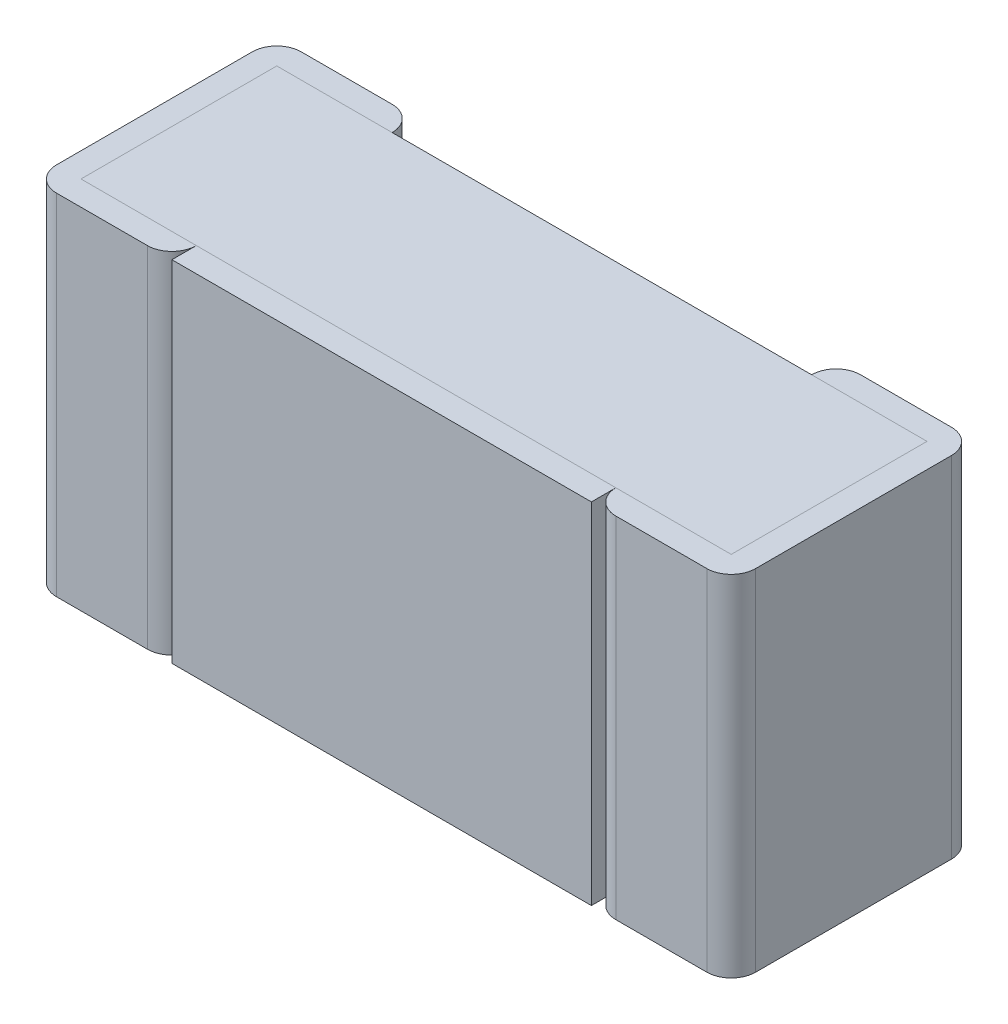
ISO-10303-21;
HEADER;
FILE_DESCRIPTION(('STEP AP214'),'2;1');
FILE_NAME('part.step','',(''),(''),'','','');
FILE_SCHEMA(('AUTOMOTIVE_DESIGN { 1 0 10303 214 1 1 1 1 }'));
ENDSEC;
DATA;
#1=APPLICATION_CONTEXT('core data for automotive mechanical design processes');
#2=APPLICATION_PROTOCOL_DEFINITION('international standard','automotive_design',2000,#1);
#3=PRODUCT_CONTEXT('',#1,'mechanical');
#4=PRODUCT('Part','Part','',(#3));
#5=PRODUCT_RELATED_PRODUCT_CATEGORY('part','',(#4));
#6=PRODUCT_DEFINITION_FORMATION('','',#4);
#7=PRODUCT_DEFINITION_CONTEXT('part definition',#1,'design');
#8=PRODUCT_DEFINITION('design','',#6,#7);
#9=PRODUCT_DEFINITION_SHAPE('','',#8);
#10=(LENGTH_UNIT() NAMED_UNIT(*) SI_UNIT(.MILLI.,.METRE.));
#11=(NAMED_UNIT(*) PLANE_ANGLE_UNIT() SI_UNIT($,.RADIAN.));
#12=(NAMED_UNIT(*) SI_UNIT($,.STERADIAN.) SOLID_ANGLE_UNIT());
#13=UNCERTAINTY_MEASURE_WITH_UNIT(LENGTH_MEASURE(1.E-05),#10,'distance_accuracy_value','');
#14=(GEOMETRIC_REPRESENTATION_CONTEXT(3) GLOBAL_UNCERTAINTY_ASSIGNED_CONTEXT((#13)) GLOBAL_UNIT_ASSIGNED_CONTEXT((#10,
#11,#12)) REPRESENTATION_CONTEXT('',''));
#15=CARTESIAN_POINT('',(0.,0.,0.));
#16=DIRECTION('',(0.,0.,1.));
#17=DIRECTION('',(1.,0.,0.));
#18=AXIS2_PLACEMENT_3D('',#15,#16,#17);
#19=CARTESIAN_POINT('',(-0.3,-0.25,0.35));
#20=DIRECTION('',(0.,0.,1.));
#21=DIRECTION('',(1.,0.,0.));
#22=AXIS2_PLACEMENT_3D('',#19,#20,#21);
#23=PLANE('',#22);
#24=DIRECTION('',(0.,1.,0.));
#25=VECTOR('',#24,1.);
#26=CARTESIAN_POINT('',(-0.3,-0.25,0.35));
#27=LINE('',#26,#25);
#28=CARTESIAN_POINT('',(-0.3,-0.25,0.35));
#29=VERTEX_POINT('',#28);
#30=CARTESIAN_POINT('',(-0.3,0.25,0.35));
#31=VERTEX_POINT('',#30);
#32=EDGE_CURVE('E383',#29,#31,#27,.T.);
#33=ORIENTED_EDGE('',*,*,#32,.F.);
#34=DIRECTION('',(1.,0.,0.));
#35=VECTOR('',#34,1.);
#36=CARTESIAN_POINT('',(-0.3,-0.25,0.35));
#37=LINE('',#36,#35);
#38=CARTESIAN_POINT('',(0.3,-0.25,0.35));
#39=VERTEX_POINT('',#38);
#40=EDGE_CURVE('E384',#29,#39,#37,.T.);
#41=ORIENTED_EDGE('',*,*,#40,.T.);
#42=DIRECTION('',(0.,1.,0.));
#43=VECTOR('',#42,1.);
#44=CARTESIAN_POINT('',(0.3,-0.25,0.35));
#45=LINE('',#44,#43);
#46=CARTESIAN_POINT('',(0.3,0.25,0.35));
#47=VERTEX_POINT('',#46);
#48=EDGE_CURVE('E11',#39,#47,#45,.T.);
#49=ORIENTED_EDGE('',*,*,#48,.T.);
#50=DIRECTION('',(1.,0.,0.));
#51=VECTOR('',#50,1.);
#52=CARTESIAN_POINT('',(-0.3,0.25,0.35));
#53=LINE('',#52,#51);
#54=EDGE_CURVE('E371',#31,#47,#53,.T.);
#55=ORIENTED_EDGE('',*,*,#54,.F.);
#56=EDGE_LOOP('',(#33,#41,#49,#55));
#57=FACE_BOUND('',#56,.T.);
#58=ADVANCED_FACE('F16',(#57),#23,.T.);
#59=CARTESIAN_POINT('',(0.3,-0.25,0.315));
#60=DIRECTION('',(1.,0.,0.));
#61=DIRECTION('',(0.,1.,0.));
#62=AXIS2_PLACEMENT_3D('',#59,#60,#61);
#63=PLANE('',#62);
#64=DIRECTION('',(0.,0.,1.));
#65=VECTOR('',#64,1.);
#66=CARTESIAN_POINT('',(0.3,-0.25,0.315));
#67=LINE('',#66,#65);
#68=CARTESIAN_POINT('',(0.3,-0.25,0.315));
#69=VERTEX_POINT('',#68);
#70=EDGE_CURVE('E472',#69,#39,#67,.T.);
#71=ORIENTED_EDGE('',*,*,#70,.F.);
#72=DIRECTION('',(0.,1.,0.));
#73=VECTOR('',#72,1.);
#74=CARTESIAN_POINT('',(0.3,-0.25,0.315));
#75=LINE('',#74,#73);
#76=CARTESIAN_POINT('',(0.3,0.25,0.315));
#77=VERTEX_POINT('',#76);
#78=EDGE_CURVE('E27',#69,#77,#75,.T.);
#79=ORIENTED_EDGE('',*,*,#78,.T.);
#80=DIRECTION('',(0.,0.,1.));
#81=VECTOR('',#80,1.);
#82=CARTESIAN_POINT('',(0.3,0.25,0.315));
#83=LINE('',#82,#81);
#84=EDGE_CURVE('E367',#77,#47,#83,.T.);
#85=ORIENTED_EDGE('',*,*,#84,.T.);
#86=ORIENTED_EDGE('',*,*,#48,.F.);
#87=EDGE_LOOP('',(#71,#79,#85,#86));
#88=FACE_BOUND('',#87,.T.);
#89=ADVANCED_FACE('F498',(#88),#63,.T.);
#90=CARTESIAN_POINT('',(0.335,-0.25,0.315));
#91=DIRECTION('',(0.,1.,0.));
#92=DIRECTION('',(-1.,0.,0.));
#93=AXIS2_PLACEMENT_3D('',#90,#91,#92);
#94=CYLINDRICAL_SURFACE('',#93,0.035);
#95=CARTESIAN_POINT('',(0.335,-0.25,0.315));
#96=DIRECTION('',(0.,1.,0.));
#97=DIRECTION('',(0.,0.,1.));
#98=AXIS2_PLACEMENT_3D('',#95,#96,#97);
#99=CIRCLE('',#98,0.035);
#100=CARTESIAN_POINT('',(0.335,-0.25,0.35));
#101=VERTEX_POINT('',#100);
#102=EDGE_CURVE('E243',#69,#101,#99,.T.);
#103=ORIENTED_EDGE('',*,*,#102,.T.);
#104=DIRECTION('',(0.,1.,0.));
#105=VECTOR('',#104,1.);
#106=CARTESIAN_POINT('',(0.335,-0.25,0.35));
#107=LINE('',#106,#105);
#108=CARTESIAN_POINT('',(0.335,0.25,0.35));
#109=VERTEX_POINT('',#108);
#110=EDGE_CURVE('E214',#101,#109,#107,.T.);
#111=ORIENTED_EDGE('',*,*,#110,.T.);
#112=CARTESIAN_POINT('',(0.335,0.25,0.315));
#113=DIRECTION('',(0.,1.,0.));
#114=DIRECTION('',(0.,0.,1.));
#115=AXIS2_PLACEMENT_3D('',#112,#113,#114);
#116=CIRCLE('',#115,0.035);
#117=EDGE_CURVE('E230',#77,#109,#116,.T.);
#118=ORIENTED_EDGE('',*,*,#117,.F.);
#119=ORIENTED_EDGE('',*,*,#78,.F.);
#120=EDGE_LOOP('',(#103,#111,#118,#119));
#121=FACE_BOUND('',#120,.T.);
#122=ADVANCED_FACE('F505',(#121),#94,.T.);
#123=CARTESIAN_POINT('',(0.3,-0.25,0.35));
#124=DIRECTION('',(0.,0.,1.));
#125=DIRECTION('',(1.,0.,0.));
#126=AXIS2_PLACEMENT_3D('',#123,#124,#125);
#127=PLANE('',#126);
#128=DIRECTION('',(1.,0.,0.));
#129=VECTOR('',#128,1.);
#130=CARTESIAN_POINT('',(0.3,0.25,0.35));
#131=LINE('',#130,#129);
#132=CARTESIAN_POINT('',(0.465,0.25,0.35));
#133=VERTEX_POINT('',#132);
#134=EDGE_CURVE('E206',#109,#133,#131,.T.);
#135=ORIENTED_EDGE('',*,*,#134,.F.);
#136=ORIENTED_EDGE('',*,*,#110,.F.);
#137=DIRECTION('',(1.,0.,0.));
#138=VECTOR('',#137,1.);
#139=CARTESIAN_POINT('',(0.3,-0.25,0.35));
#140=LINE('',#139,#138);
#141=CARTESIAN_POINT('',(0.465,-0.25,0.35));
#142=VERTEX_POINT('',#141);
#143=EDGE_CURVE('E209',#101,#142,#140,.T.);
#144=ORIENTED_EDGE('',*,*,#143,.T.);
#145=DIRECTION('',(0.,1.,0.));
#146=VECTOR('',#145,1.);
#147=CARTESIAN_POINT('',(0.465,-0.25,0.35));
#148=LINE('',#147,#146);
#149=EDGE_CURVE('E202',#142,#133,#148,.T.);
#150=ORIENTED_EDGE('',*,*,#149,.T.);
#151=EDGE_LOOP('',(#135,#136,#144,#150));
#152=FACE_BOUND('',#151,.T.);
#153=ADVANCED_FACE('F204',(#152),#127,.T.);
#154=CARTESIAN_POINT('',(0.465,-0.25,0.315));
#155=DIRECTION('',(0.,1.,0.));
#156=DIRECTION('',(1.,0.,0.));
#157=AXIS2_PLACEMENT_3D('',#154,#155,#156);
#158=CYLINDRICAL_SURFACE('',#157,0.035);
#159=DIRECTION('',(0.,1.,0.));
#160=VECTOR('',#159,1.);
#161=CARTESIAN_POINT('',(0.5,-0.25,0.315));
#162=LINE('',#161,#160);
#163=CARTESIAN_POINT('',(0.5,-0.25,0.315));
#164=VERTEX_POINT('',#163);
#165=CARTESIAN_POINT('',(0.5,0.25,0.315));
#166=VERTEX_POINT('',#165);
#167=EDGE_CURVE('E215',#164,#166,#162,.T.);
#168=ORIENTED_EDGE('',*,*,#167,.T.);
#169=CARTESIAN_POINT('',(0.465,0.25,0.315));
#170=DIRECTION('',(0.,-1.,0.));
#171=DIRECTION('',(0.,0.,1.));
#172=AXIS2_PLACEMENT_3D('',#169,#170,#171);
#173=CIRCLE('',#172,0.035);
#174=EDGE_CURVE('E218',#166,#133,#173,.T.);
#175=ORIENTED_EDGE('',*,*,#174,.T.);
#176=ORIENTED_EDGE('',*,*,#149,.F.);
#177=CARTESIAN_POINT('',(0.465,-0.25,0.315));
#178=DIRECTION('',(0.,-1.,0.));
#179=DIRECTION('',(0.,0.,1.));
#180=AXIS2_PLACEMENT_3D('',#177,#178,#179);
#181=CIRCLE('',#180,0.035);
#182=EDGE_CURVE('E287',#164,#142,#181,.T.);
#183=ORIENTED_EDGE('',*,*,#182,.F.);
#184=EDGE_LOOP('',(#168,#175,#176,#183));
#185=FACE_BOUND('',#184,.T.);
#186=ADVANCED_FACE('F219',(#185),#158,.T.);
#187=CARTESIAN_POINT('',(0.5,-0.25,0.));
#188=DIRECTION('',(1.,0.,0.));
#189=DIRECTION('',(0.,1.,0.));
#190=AXIS2_PLACEMENT_3D('',#187,#188,#189);
#191=PLANE('',#190);
#192=DIRECTION('',(0.,0.,1.));
#193=VECTOR('',#192,1.);
#194=CARTESIAN_POINT('',(0.5,-0.25,0.));
#195=LINE('',#194,#193);
#196=CARTESIAN_POINT('',(0.5,-0.25,0.035));
#197=VERTEX_POINT('',#196);
#198=EDGE_CURVE('E283',#197,#164,#195,.T.);
#199=ORIENTED_EDGE('',*,*,#198,.F.);
#200=DIRECTION('',(0.,1.,0.));
#201=VECTOR('',#200,1.);
#202=CARTESIAN_POINT('',(0.5,-0.25,0.035));
#203=LINE('',#202,#201);
#204=CARTESIAN_POINT('',(0.5,0.25,0.035));
#205=VERTEX_POINT('',#204);
#206=EDGE_CURVE('E330',#197,#205,#203,.T.);
#207=ORIENTED_EDGE('',*,*,#206,.T.);
#208=DIRECTION('',(0.,0.,1.));
#209=VECTOR('',#208,1.);
#210=CARTESIAN_POINT('',(0.5,0.25,0.));
#211=LINE('',#210,#209);
#212=EDGE_CURVE('E224',#205,#166,#211,.T.);
#213=ORIENTED_EDGE('',*,*,#212,.T.);
#214=ORIENTED_EDGE('',*,*,#167,.F.);
#215=EDGE_LOOP('',(#199,#207,#213,#214));
#216=FACE_BOUND('',#215,.T.);
#217=ADVANCED_FACE('F551',(#216),#191,.T.);
#218=CARTESIAN_POINT('',(0.465,-0.25,0.035));
#219=DIRECTION('',(0.,1.,0.));
#220=DIRECTION('',(1.,0.,0.));
#221=AXIS2_PLACEMENT_3D('',#218,#219,#220);
#222=CYLINDRICAL_SURFACE('',#221,0.035);
#223=CARTESIAN_POINT('',(0.465,-0.25,0.035));
#224=DIRECTION('',(0.,1.,0.));
#225=DIRECTION('',(0.,0.,1.));
#226=AXIS2_PLACEMENT_3D('',#223,#224,#225);
#227=CIRCLE('',#226,0.035);
#228=CARTESIAN_POINT('',(0.465,-0.25,0.));
#229=VERTEX_POINT('',#228);
#230=EDGE_CURVE('E288',#197,#229,#227,.T.);
#231=ORIENTED_EDGE('',*,*,#230,.T.);
#232=DIRECTION('',(0.,1.,0.));
#233=VECTOR('',#232,1.);
#234=CARTESIAN_POINT('',(0.465,-0.25,0.));
#235=LINE('',#234,#233);
#236=CARTESIAN_POINT('',(0.465,0.25,0.));
#237=VERTEX_POINT('',#236);
#238=EDGE_CURVE('E385',#229,#237,#235,.T.);
#239=ORIENTED_EDGE('',*,*,#238,.T.);
#240=CARTESIAN_POINT('',(0.465,0.25,0.035));
#241=DIRECTION('',(0.,1.,0.));
#242=DIRECTION('',(0.,0.,1.));
#243=AXIS2_PLACEMENT_3D('',#240,#241,#242);
#244=CIRCLE('',#243,0.035);
#245=EDGE_CURVE('E266',#205,#237,#244,.T.);
#246=ORIENTED_EDGE('',*,*,#245,.F.);
#247=ORIENTED_EDGE('',*,*,#206,.F.);
#248=EDGE_LOOP('',(#231,#239,#246,#247));
#249=FACE_BOUND('',#248,.T.);
#250=ADVANCED_FACE('F548',(#249),#222,.T.);
#251=CARTESIAN_POINT('',(0.3,-0.25,0.));
#252=DIRECTION('',(0.,0.,1.));
#253=DIRECTION('',(1.,0.,0.));
#254=AXIS2_PLACEMENT_3D('',#251,#252,#253);
#255=PLANE('',#254);
#256=ORIENTED_EDGE('',*,*,#238,.F.);
#257=DIRECTION('',(1.,0.,0.));
#258=VECTOR('',#257,1.);
#259=CARTESIAN_POINT('',(0.3,-0.25,0.));
#260=LINE('',#259,#258);
#261=CARTESIAN_POINT('',(0.335,-0.25,0.));
#262=VERTEX_POINT('',#261);
#263=EDGE_CURVE('E476',#262,#229,#260,.T.);
#264=ORIENTED_EDGE('',*,*,#263,.F.);
#265=DIRECTION('',(0.,1.,0.));
#266=VECTOR('',#265,1.);
#267=CARTESIAN_POINT('',(0.335,-0.25,0.));
#268=LINE('',#267,#266);
#269=CARTESIAN_POINT('',(0.335,0.25,0.));
#270=VERTEX_POINT('',#269);
#271=EDGE_CURVE('E370',#262,#270,#268,.T.);
#272=ORIENTED_EDGE('',*,*,#271,.T.);
#273=DIRECTION('',(1.,0.,0.));
#274=VECTOR('',#273,1.);
#275=CARTESIAN_POINT('',(0.3,0.25,0.));
#276=LINE('',#275,#274);
#277=EDGE_CURVE('E450',#270,#237,#276,.T.);
#278=ORIENTED_EDGE('',*,*,#277,.T.);
#279=EDGE_LOOP('',(#256,#264,#272,#278));
#280=FACE_BOUND('',#279,.T.);
#281=ADVANCED_FACE('F538',(#280),#255,.F.);
#282=CARTESIAN_POINT('',(0.335,-0.25,0.035));
#283=DIRECTION('',(0.,1.,0.));
#284=DIRECTION('',(-1.,0.,0.));
#285=AXIS2_PLACEMENT_3D('',#282,#283,#284);
#286=CYLINDRICAL_SURFACE('',#285,0.035);
#287=DIRECTION('',(0.,1.,0.));
#288=VECTOR('',#287,1.);
#289=CARTESIAN_POINT('',(0.3,-0.25,0.035));
#290=LINE('',#289,#288);
#291=CARTESIAN_POINT('',(0.3,-0.25,0.035));
#292=VERTEX_POINT('',#291);
#293=CARTESIAN_POINT('',(0.3,0.25,0.035));
#294=VERTEX_POINT('',#293);
#295=EDGE_CURVE('E319',#292,#294,#290,.T.);
#296=ORIENTED_EDGE('',*,*,#295,.T.);
#297=CARTESIAN_POINT('',(0.335,0.25,0.035));
#298=DIRECTION('',(0.,-1.,0.));
#299=DIRECTION('',(0.,0.,1.));
#300=AXIS2_PLACEMENT_3D('',#297,#298,#299);
#301=CIRCLE('',#300,0.035);
#302=EDGE_CURVE('E237',#294,#270,#301,.T.);
#303=ORIENTED_EDGE('',*,*,#302,.T.);
#304=ORIENTED_EDGE('',*,*,#271,.F.);
#305=CARTESIAN_POINT('',(0.335,-0.25,0.035));
#306=DIRECTION('',(0.,-1.,0.));
#307=DIRECTION('',(0.,0.,1.));
#308=AXIS2_PLACEMENT_3D('',#305,#306,#307);
#309=CIRCLE('',#308,0.035);
#310=EDGE_CURVE('E246',#292,#262,#309,.T.);
#311=ORIENTED_EDGE('',*,*,#310,.F.);
#312=EDGE_LOOP('',(#296,#303,#304,#311));
#313=FACE_BOUND('',#312,.T.);
#314=ADVANCED_FACE('F533',(#313),#286,.T.);
#315=CARTESIAN_POINT('',(-0.3,0.25,0.315));
#316=DIRECTION('',(0.,1.,0.));
#317=DIRECTION('',(1.,0.,0.));
#318=AXIS2_PLACEMENT_3D('',#315,#316,#317);
#319=PLANE('',#318);
#320=DIRECTION('',(1.,0.,0.));
#321=VECTOR('',#320,1.);
#322=CARTESIAN_POINT('',(-0.3,0.25,0.315));
#323=LINE('',#322,#321);
#324=CARTESIAN_POINT('',(-0.3,0.25,0.315));
#325=VERTEX_POINT('',#324);
#326=EDGE_CURVE('E258',#325,#77,#323,.T.);
#327=ORIENTED_EDGE('',*,*,#326,.F.);
#328=DIRECTION('',(0.,0.,1.));
#329=VECTOR('',#328,1.);
#330=CARTESIAN_POINT('',(-0.3,0.25,0.315));
#331=LINE('',#330,#329);
#332=EDGE_CURVE('E408',#325,#31,#331,.T.);
#333=ORIENTED_EDGE('',*,*,#332,.T.);
#334=ORIENTED_EDGE('',*,*,#54,.T.);
#335=ORIENTED_EDGE('',*,*,#84,.F.);
#336=EDGE_LOOP('',(#327,#333,#334,#335));
#337=FACE_BOUND('',#336,.T.);
#338=ADVANCED_FACE('F513',(#337),#319,.T.);
#339=CARTESIAN_POINT('',(0.3,0.25,0.));
#340=DIRECTION('',(0.,1.,0.));
#341=DIRECTION('',(1.,0.,0.));
#342=AXIS2_PLACEMENT_3D('',#339,#340,#341);
#343=PLANE('',#342);
#344=ORIENTED_EDGE('',*,*,#277,.F.);
#345=ORIENTED_EDGE('',*,*,#302,.F.);
#346=DIRECTION('',(1.,0.,0.));
#347=VECTOR('',#346,1.);
#348=CARTESIAN_POINT('',(-0.465,0.25,0.035));
#349=LINE('',#348,#347);
#350=CARTESIAN_POINT('',(0.465,0.25,0.035));
#351=VERTEX_POINT('',#350);
#352=EDGE_CURVE('E402',#294,#351,#349,.T.);
#353=ORIENTED_EDGE('',*,*,#352,.T.);
#354=DIRECTION('',(0.,0.,1.));
#355=VECTOR('',#354,1.);
#356=CARTESIAN_POINT('',(0.465,0.25,0.035));
#357=LINE('',#356,#355);
#358=CARTESIAN_POINT('',(0.465,0.25,0.315));
#359=VERTEX_POINT('',#358);
#360=EDGE_CURVE('E257',#351,#359,#357,.T.);
#361=ORIENTED_EDGE('',*,*,#360,.T.);
#362=DIRECTION('',(1.,0.,0.));
#363=VECTOR('',#362,1.);
#364=CARTESIAN_POINT('',(-0.465,0.25,0.315));
#365=LINE('',#364,#363);
#366=EDGE_CURVE('E253',#77,#359,#365,.T.);
#367=ORIENTED_EDGE('',*,*,#366,.F.);
#368=ORIENTED_EDGE('',*,*,#117,.T.);
#369=ORIENTED_EDGE('',*,*,#134,.T.);
#370=ORIENTED_EDGE('',*,*,#174,.F.);
#371=ORIENTED_EDGE('',*,*,#212,.F.);
#372=ORIENTED_EDGE('',*,*,#245,.T.);
#373=EDGE_LOOP('',(#344,#345,#353,#361,#367,#368,#369,#370,#371,#372));
#374=FACE_BOUND('',#373,.T.);
#375=ADVANCED_FACE('F227',(#374),#343,.T.);
#376=CARTESIAN_POINT('',(-0.3,-0.25,0.315));
#377=DIRECTION('',(1.,0.,0.));
#378=DIRECTION('',(0.,1.,0.));
#379=AXIS2_PLACEMENT_3D('',#376,#377,#378);
#380=PLANE('',#379);
#381=ORIENTED_EDGE('',*,*,#32,.T.);
#382=ORIENTED_EDGE('',*,*,#332,.F.);
#383=DIRECTION('',(0.,1.,0.));
#384=VECTOR('',#383,1.);
#385=CARTESIAN_POINT('',(-0.3,-0.25,0.315));
#386=LINE('',#385,#384);
#387=CARTESIAN_POINT('',(-0.3,-0.25,0.315));
#388=VERTEX_POINT('',#387);
#389=EDGE_CURVE('E324',#388,#325,#386,.T.);
#390=ORIENTED_EDGE('',*,*,#389,.F.);
#391=DIRECTION('',(0.,0.,1.));
#392=VECTOR('',#391,1.);
#393=CARTESIAN_POINT('',(-0.3,-0.25,0.315));
#394=LINE('',#393,#392);
#395=EDGE_CURVE('E379',#388,#29,#394,.T.);
#396=ORIENTED_EDGE('',*,*,#395,.T.);
#397=EDGE_LOOP('',(#381,#382,#390,#396));
#398=FACE_BOUND('',#397,.T.);
#399=ADVANCED_FACE('F518',(#398),#380,.F.);
#400=CARTESIAN_POINT('',(-0.3,-0.25,0.315));
#401=DIRECTION('',(0.,1.,0.));
#402=DIRECTION('',(1.,0.,0.));
#403=AXIS2_PLACEMENT_3D('',#400,#401,#402);
#404=PLANE('',#403);
#405=ORIENTED_EDGE('',*,*,#70,.T.);
#406=ORIENTED_EDGE('',*,*,#40,.F.);
#407=ORIENTED_EDGE('',*,*,#395,.F.);
#408=DIRECTION('',(1.,0.,0.));
#409=VECTOR('',#408,1.);
#410=CARTESIAN_POINT('',(-0.3,-0.25,0.315));
#411=LINE('',#410,#409);
#412=EDGE_CURVE('E303',#388,#69,#411,.T.);
#413=ORIENTED_EDGE('',*,*,#412,.T.);
#414=EDGE_LOOP('',(#405,#406,#407,#413));
#415=FACE_BOUND('',#414,.T.);
#416=ADVANCED_FACE('F493',(#415),#404,.F.);
#417=CARTESIAN_POINT('',(0.3,-0.25,0.));
#418=DIRECTION('',(0.,1.,0.));
#419=DIRECTION('',(1.,0.,0.));
#420=AXIS2_PLACEMENT_3D('',#417,#418,#419);
#421=PLANE('',#420);
#422=ORIENTED_EDGE('',*,*,#230,.F.);
#423=ORIENTED_EDGE('',*,*,#198,.T.);
#424=ORIENTED_EDGE('',*,*,#182,.T.);
#425=ORIENTED_EDGE('',*,*,#143,.F.);
#426=ORIENTED_EDGE('',*,*,#102,.F.);
#427=DIRECTION('',(1.,0.,0.));
#428=VECTOR('',#427,1.);
#429=CARTESIAN_POINT('',(-0.465,-0.25,0.315));
#430=LINE('',#429,#428);
#431=CARTESIAN_POINT('',(0.465,-0.25,0.315));
#432=VERTEX_POINT('',#431);
#433=EDGE_CURVE('E308',#69,#432,#430,.T.);
#434=ORIENTED_EDGE('',*,*,#433,.T.);
#435=DIRECTION('',(0.,0.,1.));
#436=VECTOR('',#435,1.);
#437=CARTESIAN_POINT('',(0.465,-0.25,0.035));
#438=LINE('',#437,#436);
#439=CARTESIAN_POINT('',(0.465,-0.25,0.035));
#440=VERTEX_POINT('',#439);
#441=EDGE_CURVE('E343',#440,#432,#438,.T.);
#442=ORIENTED_EDGE('',*,*,#441,.F.);
#443=DIRECTION('',(1.,0.,0.));
#444=VECTOR('',#443,1.);
#445=CARTESIAN_POINT('',(-0.465,-0.25,0.035));
#446=LINE('',#445,#444);
#447=EDGE_CURVE('E339',#292,#440,#446,.T.);
#448=ORIENTED_EDGE('',*,*,#447,.F.);
#449=ORIENTED_EDGE('',*,*,#310,.T.);
#450=ORIENTED_EDGE('',*,*,#263,.T.);
#451=EDGE_LOOP('',(#422,#423,#424,#425,#426,#434,#442,#448,#449,#450));
#452=FACE_BOUND('',#451,.T.);
#453=ADVANCED_FACE('F502',(#452),#421,.F.);
#454=CARTESIAN_POINT('',(-0.465,-0.25,0.035));
#455=DIRECTION('',(0.,0.,1.));
#456=DIRECTION('',(1.,0.,0.));
#457=AXIS2_PLACEMENT_3D('',#454,#455,#456);
#458=PLANE('',#457);
#459=DIRECTION('',(1.,0.,0.));
#460=VECTOR('',#459,1.);
#461=CARTESIAN_POINT('',(-0.465,0.25,0.035));
#462=LINE('',#461,#460);
#463=CARTESIAN_POINT('',(-0.3,0.25,0.035));
#464=VERTEX_POINT('',#463);
#465=EDGE_CURVE('E323',#464,#294,#462,.T.);
#466=ORIENTED_EDGE('',*,*,#465,.T.);
#467=ORIENTED_EDGE('',*,*,#295,.F.);
#468=DIRECTION('',(1.,0.,0.));
#469=VECTOR('',#468,1.);
#470=CARTESIAN_POINT('',(-0.465,-0.25,0.035));
#471=LINE('',#470,#469);
#472=CARTESIAN_POINT('',(-0.3,-0.25,0.035));
#473=VERTEX_POINT('',#472);
#474=EDGE_CURVE('E344',#473,#292,#471,.T.);
#475=ORIENTED_EDGE('',*,*,#474,.F.);
#476=DIRECTION('',(0.,1.,0.));
#477=VECTOR('',#476,1.);
#478=CARTESIAN_POINT('',(-0.3,-0.25,0.035));
#479=LINE('',#478,#477);
#480=EDGE_CURVE('E334',#473,#464,#479,.T.);
#481=ORIENTED_EDGE('',*,*,#480,.T.);
#482=EDGE_LOOP('',(#466,#467,#475,#481));
#483=FACE_BOUND('',#482,.T.);
#484=ADVANCED_FACE('F602',(#483),#458,.F.);
#485=CARTESIAN_POINT('',(-0.465,0.25,0.035));
#486=DIRECTION('',(0.,1.,0.));
#487=DIRECTION('',(1.,0.,0.));
#488=AXIS2_PLACEMENT_3D('',#485,#486,#487);
#489=PLANE('',#488);
#490=DIRECTION('',(1.,0.,0.));
#491=VECTOR('',#490,1.);
#492=CARTESIAN_POINT('',(-0.465,0.25,0.035));
#493=LINE('',#492,#491);
#494=CARTESIAN_POINT('',(-0.465,0.25,0.035));
#495=VERTEX_POINT('',#494);
#496=EDGE_CURVE('E309',#495,#464,#493,.T.);
#497=ORIENTED_EDGE('',*,*,#496,.F.);
#498=DIRECTION('',(0.,0.,1.));
#499=VECTOR('',#498,1.);
#500=CARTESIAN_POINT('',(-0.465,0.25,0.035));
#501=LINE('',#500,#499);
#502=CARTESIAN_POINT('',(-0.465,0.25,0.315));
#503=VERTEX_POINT('',#502);
#504=EDGE_CURVE('E281',#495,#503,#501,.T.);
#505=ORIENTED_EDGE('',*,*,#504,.T.);
#506=DIRECTION('',(1.,0.,0.));
#507=VECTOR('',#506,1.);
#508=CARTESIAN_POINT('',(-0.465,0.25,0.315));
#509=LINE('',#508,#507);
#510=EDGE_CURVE('E277',#503,#325,#509,.T.);
#511=ORIENTED_EDGE('',*,*,#510,.T.);
#512=ORIENTED_EDGE('',*,*,#326,.T.);
#513=ORIENTED_EDGE('',*,*,#366,.T.);
#514=ORIENTED_EDGE('',*,*,#360,.F.);
#515=ORIENTED_EDGE('',*,*,#352,.F.);
#516=ORIENTED_EDGE('',*,*,#465,.F.);
#517=EDGE_LOOP('',(#497,#505,#511,#512,#513,#514,#515,#516));
#518=FACE_BOUND('',#517,.T.);
#519=ADVANCED_FACE('F510',(#518),#489,.T.);
#520=CARTESIAN_POINT('',(-0.335,-0.25,0.315));
#521=DIRECTION('',(0.,1.,0.));
#522=DIRECTION('',(1.,0.,0.));
#523=AXIS2_PLACEMENT_3D('',#520,#521,#522);
#524=CYLINDRICAL_SURFACE('',#523,0.035);
#525=ORIENTED_EDGE('',*,*,#389,.T.);
#526=CARTESIAN_POINT('',(-0.335,0.25,0.315));
#527=DIRECTION('',(0.,-1.,0.));
#528=DIRECTION('',(0.,0.,1.));
#529=AXIS2_PLACEMENT_3D('',#526,#527,#528);
#530=CIRCLE('',#529,0.035);
#531=CARTESIAN_POINT('',(-0.335,0.25,0.35));
#532=VERTEX_POINT('',#531);
#533=EDGE_CURVE('E282',#325,#532,#530,.T.);
#534=ORIENTED_EDGE('',*,*,#533,.T.);
#535=DIRECTION('',(0.,1.,0.));
#536=VECTOR('',#535,1.);
#537=CARTESIAN_POINT('',(-0.335,-0.25,0.35));
#538=LINE('',#537,#536);
#539=CARTESIAN_POINT('',(-0.335,-0.25,0.35));
#540=VERTEX_POINT('',#539);
#541=EDGE_CURVE('E307',#540,#532,#538,.T.);
#542=ORIENTED_EDGE('',*,*,#541,.F.);
#543=CARTESIAN_POINT('',(-0.335,-0.25,0.315));
#544=DIRECTION('',(0.,-1.,0.));
#545=DIRECTION('',(0.,0.,1.));
#546=AXIS2_PLACEMENT_3D('',#543,#544,#545);
#547=CIRCLE('',#546,0.035);
#548=EDGE_CURVE('E20',#388,#540,#547,.T.);
#549=ORIENTED_EDGE('',*,*,#548,.F.);
#550=EDGE_LOOP('',(#525,#534,#542,#549));
#551=FACE_BOUND('',#550,.T.);
#552=ADVANCED_FACE('F516',(#551),#524,.T.);
#553=CARTESIAN_POINT('',(-0.5,-0.25,0.35));
#554=DIRECTION('',(0.,0.,1.));
#555=DIRECTION('',(1.,0.,0.));
#556=AXIS2_PLACEMENT_3D('',#553,#554,#555);
#557=PLANE('',#556);
#558=DIRECTION('',(1.,0.,0.));
#559=VECTOR('',#558,1.);
#560=CARTESIAN_POINT('',(-0.5,0.25,0.35));
#561=LINE('',#560,#559);
#562=CARTESIAN_POINT('',(-0.465,0.25,0.35));
#563=VERTEX_POINT('',#562);
#564=EDGE_CURVE('E270',#563,#532,#561,.T.);
#565=ORIENTED_EDGE('',*,*,#564,.F.);
#566=DIRECTION('',(0.,1.,0.));
#567=VECTOR('',#566,1.);
#568=CARTESIAN_POINT('',(-0.465,-0.25,0.35));
#569=LINE('',#568,#567);
#570=CARTESIAN_POINT('',(-0.465,-0.25,0.35));
#571=VERTEX_POINT('',#570);
#572=EDGE_CURVE('E276',#571,#563,#569,.T.);
#573=ORIENTED_EDGE('',*,*,#572,.F.);
#574=DIRECTION('',(1.,0.,0.));
#575=VECTOR('',#574,1.);
#576=CARTESIAN_POINT('',(-0.5,-0.25,0.35));
#577=LINE('',#576,#575);
#578=EDGE_CURVE('E396',#571,#540,#577,.T.);
#579=ORIENTED_EDGE('',*,*,#578,.T.);
#580=ORIENTED_EDGE('',*,*,#541,.T.);
#581=EDGE_LOOP('',(#565,#573,#579,#580));
#582=FACE_BOUND('',#581,.T.);
#583=ADVANCED_FACE('F429',(#582),#557,.T.);
#584=CARTESIAN_POINT('',(-0.465,-0.25,0.035));
#585=DIRECTION('',(0.,1.,0.));
#586=DIRECTION('',(1.,0.,0.));
#587=AXIS2_PLACEMENT_3D('',#584,#585,#586);
#588=PLANE('',#587);
#589=ORIENTED_EDGE('',*,*,#474,.T.);
#590=ORIENTED_EDGE('',*,*,#447,.T.);
#591=ORIENTED_EDGE('',*,*,#441,.T.);
#592=ORIENTED_EDGE('',*,*,#433,.F.);
#593=ORIENTED_EDGE('',*,*,#412,.F.);
#594=DIRECTION('',(1.,0.,0.));
#595=VECTOR('',#594,1.);
#596=CARTESIAN_POINT('',(-0.465,-0.25,0.315));
#597=LINE('',#596,#595);
#598=CARTESIAN_POINT('',(-0.465,-0.25,0.315));
#599=VERTEX_POINT('',#598);
#600=EDGE_CURVE('E298',#599,#388,#597,.T.);
#601=ORIENTED_EDGE('',*,*,#600,.F.);
#602=DIRECTION('',(0.,0.,1.));
#603=VECTOR('',#602,1.);
#604=CARTESIAN_POINT('',(-0.465,-0.25,0.035));
#605=LINE('',#604,#603);
#606=CARTESIAN_POINT('',(-0.465,-0.25,0.035));
#607=VERTEX_POINT('',#606);
#608=EDGE_CURVE('E302',#607,#599,#605,.T.);
#609=ORIENTED_EDGE('',*,*,#608,.F.);
#610=DIRECTION('',(1.,0.,0.));
#611=VECTOR('',#610,1.);
#612=CARTESIAN_POINT('',(-0.465,-0.25,0.035));
#613=LINE('',#612,#611);
#614=EDGE_CURVE('E241',#607,#473,#613,.T.);
#615=ORIENTED_EDGE('',*,*,#614,.T.);
#616=EDGE_LOOP('',(#589,#590,#591,#592,#593,#601,#609,#615));
#617=FACE_BOUND('',#616,.T.);
#618=ADVANCED_FACE('F520',(#617),#588,.F.);
#619=CARTESIAN_POINT('',(-0.335,-0.25,0.035));
#620=DIRECTION('',(0.,1.,0.));
#621=DIRECTION('',(1.,0.,0.));
#622=AXIS2_PLACEMENT_3D('',#619,#620,#621);
#623=CYLINDRICAL_SURFACE('',#622,0.035);
#624=CARTESIAN_POINT('',(-0.335,-0.25,0.035));
#625=DIRECTION('',(0.,1.,0.));
#626=DIRECTION('',(0.,0.,1.));
#627=AXIS2_PLACEMENT_3D('',#624,#625,#626);
#628=CIRCLE('',#627,0.035);
#629=CARTESIAN_POINT('',(-0.335,-0.25,0.));
#630=VERTEX_POINT('',#629);
#631=EDGE_CURVE('E357',#473,#630,#628,.T.);
#632=ORIENTED_EDGE('',*,*,#631,.T.);
#633=DIRECTION('',(0.,1.,0.));
#634=VECTOR('',#633,1.);
#635=CARTESIAN_POINT('',(-0.335,-0.25,0.));
#636=LINE('',#635,#634);
#637=CARTESIAN_POINT('',(-0.335,0.25,0.));
#638=VERTEX_POINT('',#637);
#639=EDGE_CURVE('E331',#630,#638,#636,.T.);
#640=ORIENTED_EDGE('',*,*,#639,.T.);
#641=CARTESIAN_POINT('',(-0.335,0.25,0.035));
#642=DIRECTION('',(0.,1.,0.));
#643=DIRECTION('',(0.,0.,1.));
#644=AXIS2_PLACEMENT_3D('',#641,#642,#643);
#645=CIRCLE('',#644,0.035);
#646=EDGE_CURVE('E313',#464,#638,#645,.T.);
#647=ORIENTED_EDGE('',*,*,#646,.F.);
#648=ORIENTED_EDGE('',*,*,#480,.F.);
#649=EDGE_LOOP('',(#632,#640,#647,#648));
#650=FACE_BOUND('',#649,.T.);
#651=ADVANCED_FACE('F574',(#650),#623,.T.);
#652=CARTESIAN_POINT('',(-0.5,-0.25,0.));
#653=DIRECTION('',(0.,0.,1.));
#654=DIRECTION('',(1.,0.,0.));
#655=AXIS2_PLACEMENT_3D('',#652,#653,#654);
#656=PLANE('',#655);
#657=ORIENTED_EDGE('',*,*,#639,.F.);
#658=DIRECTION('',(1.,0.,0.));
#659=VECTOR('',#658,1.);
#660=CARTESIAN_POINT('',(-0.5,-0.25,0.));
#661=LINE('',#660,#659);
#662=CARTESIAN_POINT('',(-0.465,-0.25,0.));
#663=VERTEX_POINT('',#662);
#664=EDGE_CURVE('E252',#663,#630,#661,.T.);
#665=ORIENTED_EDGE('',*,*,#664,.F.);
#666=DIRECTION('',(0.,1.,0.));
#667=VECTOR('',#666,1.);
#668=CARTESIAN_POINT('',(-0.465,-0.25,0.));
#669=LINE('',#668,#667);
#670=CARTESIAN_POINT('',(-0.465,0.25,0.));
#671=VERTEX_POINT('',#670);
#672=EDGE_CURVE('E251',#663,#671,#669,.T.);
#673=ORIENTED_EDGE('',*,*,#672,.T.);
#674=DIRECTION('',(1.,0.,0.));
#675=VECTOR('',#674,1.);
#676=CARTESIAN_POINT('',(-0.5,0.25,0.));
#677=LINE('',#676,#675);
#678=EDGE_CURVE('E267',#671,#638,#677,.T.);
#679=ORIENTED_EDGE('',*,*,#678,.T.);
#680=EDGE_LOOP('',(#657,#665,#673,#679));
#681=FACE_BOUND('',#680,.T.);
#682=ADVANCED_FACE('F441',(#681),#656,.F.);
#683=CARTESIAN_POINT('',(-0.5,0.25,0.));
#684=DIRECTION('',(0.,1.,0.));
#685=DIRECTION('',(1.,0.,0.));
#686=AXIS2_PLACEMENT_3D('',#683,#684,#685);
#687=PLANE('',#686);
#688=ORIENTED_EDGE('',*,*,#678,.F.);
#689=CARTESIAN_POINT('',(-0.465,0.25,0.035));
#690=DIRECTION('',(0.,-1.,0.));
#691=DIRECTION('',(0.,0.,1.));
#692=AXIS2_PLACEMENT_3D('',#689,#690,#691);
#693=CIRCLE('',#692,0.035);
#694=CARTESIAN_POINT('',(-0.5,0.25,0.035));
#695=VERTEX_POINT('',#694);
#696=EDGE_CURVE('E247',#695,#671,#693,.T.);
#697=ORIENTED_EDGE('',*,*,#696,.F.);
#698=DIRECTION('',(0.,0.,1.));
#699=VECTOR('',#698,1.);
#700=CARTESIAN_POINT('',(-0.5,0.25,0.));
#701=LINE('',#700,#699);
#702=CARTESIAN_POINT('',(-0.5,0.25,0.315));
#703=VERTEX_POINT('',#702);
#704=EDGE_CURVE('E294',#695,#703,#701,.T.);
#705=ORIENTED_EDGE('',*,*,#704,.T.);
#706=CARTESIAN_POINT('',(-0.465,0.25,0.315));
#707=DIRECTION('',(0.,1.,0.));
#708=DIRECTION('',(0.,0.,1.));
#709=AXIS2_PLACEMENT_3D('',#706,#707,#708);
#710=CIRCLE('',#709,0.035);
#711=EDGE_CURVE('E271',#703,#563,#710,.T.);
#712=ORIENTED_EDGE('',*,*,#711,.T.);
#713=ORIENTED_EDGE('',*,*,#564,.T.);
#714=ORIENTED_EDGE('',*,*,#533,.F.);
#715=ORIENTED_EDGE('',*,*,#510,.F.);
#716=ORIENTED_EDGE('',*,*,#504,.F.);
#717=ORIENTED_EDGE('',*,*,#496,.T.);
#718=ORIENTED_EDGE('',*,*,#646,.T.);
#719=EDGE_LOOP('',(#688,#697,#705,#712,#713,#714,#715,#716,#717,#718));
#720=FACE_BOUND('',#719,.T.);
#721=ADVANCED_FACE('F432',(#720),#687,.T.);
#722=CARTESIAN_POINT('',(-0.465,-0.25,0.315));
#723=DIRECTION('',(0.,1.,0.));
#724=DIRECTION('',(-1.,0.,0.));
#725=AXIS2_PLACEMENT_3D('',#722,#723,#724);
#726=CYLINDRICAL_SURFACE('',#725,0.035);
#727=CARTESIAN_POINT('',(-0.465,-0.25,0.315));
#728=DIRECTION('',(0.,1.,0.));
#729=DIRECTION('',(0.,0.,1.));
#730=AXIS2_PLACEMENT_3D('',#727,#728,#729);
#731=CIRCLE('',#730,0.035);
#732=CARTESIAN_POINT('',(-0.5,-0.25,0.315));
#733=VERTEX_POINT('',#732);
#734=EDGE_CURVE('E263',#733,#571,#731,.T.);
#735=ORIENTED_EDGE('',*,*,#734,.T.);
#736=ORIENTED_EDGE('',*,*,#572,.T.);
#737=ORIENTED_EDGE('',*,*,#711,.F.);
#738=DIRECTION('',(0.,1.,0.));
#739=VECTOR('',#738,1.);
#740=CARTESIAN_POINT('',(-0.5,-0.25,0.315));
#741=LINE('',#740,#739);
#742=EDGE_CURVE('E335',#733,#703,#741,.T.);
#743=ORIENTED_EDGE('',*,*,#742,.F.);
#744=EDGE_LOOP('',(#735,#736,#737,#743));
#745=FACE_BOUND('',#744,.T.);
#746=ADVANCED_FACE('F421',(#745),#726,.T.);
#747=CARTESIAN_POINT('',(-0.465,-0.25,0.035));
#748=DIRECTION('',(0.,1.,0.));
#749=DIRECTION('',(-1.,0.,0.));
#750=AXIS2_PLACEMENT_3D('',#747,#748,#749);
#751=CYLINDRICAL_SURFACE('',#750,0.035);
#752=DIRECTION('',(0.,1.,0.));
#753=VECTOR('',#752,1.);
#754=CARTESIAN_POINT('',(-0.5,-0.25,0.035));
#755=LINE('',#754,#753);
#756=CARTESIAN_POINT('',(-0.5,-0.25,0.035));
#757=VERTEX_POINT('',#756);
#758=EDGE_CURVE('E289',#757,#695,#755,.T.);
#759=ORIENTED_EDGE('',*,*,#758,.T.);
#760=ORIENTED_EDGE('',*,*,#696,.T.);
#761=ORIENTED_EDGE('',*,*,#672,.F.);
#762=CARTESIAN_POINT('',(-0.465,-0.25,0.035));
#763=DIRECTION('',(0.,-1.,0.));
#764=DIRECTION('',(0.,0.,1.));
#765=AXIS2_PLACEMENT_3D('',#762,#763,#764);
#766=CIRCLE('',#765,0.035);
#767=EDGE_CURVE('E259',#757,#663,#766,.T.);
#768=ORIENTED_EDGE('',*,*,#767,.F.);
#769=EDGE_LOOP('',(#759,#760,#761,#768));
#770=FACE_BOUND('',#769,.T.);
#771=ADVANCED_FACE('F439',(#770),#751,.T.);
#772=CARTESIAN_POINT('',(-0.5,-0.25,0.));
#773=DIRECTION('',(0.,1.,0.));
#774=DIRECTION('',(1.,0.,0.));
#775=AXIS2_PLACEMENT_3D('',#772,#773,#774);
#776=PLANE('',#775);
#777=ORIENTED_EDGE('',*,*,#631,.F.);
#778=ORIENTED_EDGE('',*,*,#614,.F.);
#779=ORIENTED_EDGE('',*,*,#608,.T.);
#780=ORIENTED_EDGE('',*,*,#600,.T.);
#781=ORIENTED_EDGE('',*,*,#548,.T.);
#782=ORIENTED_EDGE('',*,*,#578,.F.);
#783=ORIENTED_EDGE('',*,*,#734,.F.);
#784=DIRECTION('',(0.,0.,1.));
#785=VECTOR('',#784,1.);
#786=CARTESIAN_POINT('',(-0.5,-0.25,0.));
#787=LINE('',#786,#785);
#788=EDGE_CURVE('E293',#757,#733,#787,.T.);
#789=ORIENTED_EDGE('',*,*,#788,.F.);
#790=ORIENTED_EDGE('',*,*,#767,.T.);
#791=ORIENTED_EDGE('',*,*,#664,.T.);
#792=EDGE_LOOP('',(#777,#778,#779,#780,#781,#782,#783,#789,#790,#791));
#793=FACE_BOUND('',#792,.T.);
#794=ADVANCED_FACE('F426',(#793),#776,.F.);
#795=CARTESIAN_POINT('',(-0.5,-0.25,0.));
#796=DIRECTION('',(1.,0.,0.));
#797=DIRECTION('',(0.,1.,0.));
#798=AXIS2_PLACEMENT_3D('',#795,#796,#797);
#799=PLANE('',#798);
#800=ORIENTED_EDGE('',*,*,#742,.T.);
#801=ORIENTED_EDGE('',*,*,#704,.F.);
#802=ORIENTED_EDGE('',*,*,#758,.F.);
#803=ORIENTED_EDGE('',*,*,#788,.T.);
#804=EDGE_LOOP('',(#800,#801,#802,#803));
#805=FACE_BOUND('',#804,.T.);
#806=ADVANCED_FACE('F18',(#805),#799,.F.);
#807=CLOSED_SHELL('',(#58,#89,#122,#153,#186,#217,#250,#281,#314,#338,#375,#399,#416,#453,#484,
#519,#552,#583,#618,#651,#682,#721,#746,#771,#794,#806));
#808=MANIFOLD_SOLID_BREP('B1',#807);
#809=ADVANCED_BREP_SHAPE_REPRESENTATION('',(#18,#808),#14);
#810=SHAPE_DEFINITION_REPRESENTATION(#9,#809);
ENDSEC;
END-ISO-10303-21;
